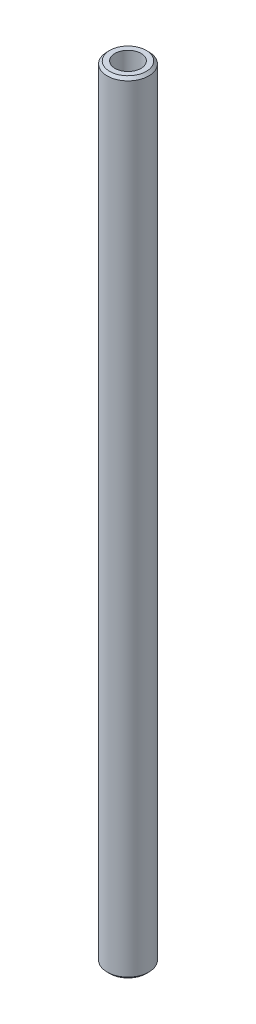
ISO-10303-21;
HEADER;
FILE_DESCRIPTION(('STEP AP214'),'2;1');
FILE_NAME('part.step','',(''),(''),'','','');
FILE_SCHEMA(('AUTOMOTIVE_DESIGN { 1 0 10303 214 1 1 1 1 }'));
ENDSEC;
DATA;
#1=APPLICATION_CONTEXT('core data for automotive mechanical design processes');
#2=APPLICATION_PROTOCOL_DEFINITION('international standard','automotive_design',2000,#1);
#3=PRODUCT_CONTEXT('',#1,'mechanical');
#4=PRODUCT('Part','Part','',(#3));
#5=PRODUCT_RELATED_PRODUCT_CATEGORY('part','',(#4));
#6=PRODUCT_DEFINITION_FORMATION('','',#4);
#7=PRODUCT_DEFINITION_CONTEXT('part definition',#1,'design');
#8=PRODUCT_DEFINITION('design','',#6,#7);
#9=PRODUCT_DEFINITION_SHAPE('','',#8);
#10=(LENGTH_UNIT() NAMED_UNIT(*) SI_UNIT(.MILLI.,.METRE.));
#11=(NAMED_UNIT(*) PLANE_ANGLE_UNIT() SI_UNIT($,.RADIAN.));
#12=(NAMED_UNIT(*) SI_UNIT($,.STERADIAN.) SOLID_ANGLE_UNIT());
#13=UNCERTAINTY_MEASURE_WITH_UNIT(LENGTH_MEASURE(1.E-05),#10,'distance_accuracy_value','');
#14=(GEOMETRIC_REPRESENTATION_CONTEXT(3) GLOBAL_UNCERTAINTY_ASSIGNED_CONTEXT((#13)) GLOBAL_UNIT_ASSIGNED_CONTEXT((#10,
#11,#12)) REPRESENTATION_CONTEXT('',''));
#15=CARTESIAN_POINT('',(0.,0.,0.));
#16=DIRECTION('',(0.,0.,1.));
#17=DIRECTION('',(1.,0.,0.));
#18=AXIS2_PLACEMENT_3D('',#15,#16,#17);
#19=CARTESIAN_POINT('',(0.,150.,0.));
#20=DIRECTION('',(0.,-1.,0.));
#21=DIRECTION('',(0.,0.,-1.));
#22=AXIS2_PLACEMENT_3D('',#19,#20,#21);
#23=CYLINDRICAL_SURFACE('',#22,4.);
#24=CARTESIAN_POINT('',(0.,149.5,0.));
#25=DIRECTION('',(0.,1.,0.));
#26=DIRECTION('',(0.,0.,1.));
#27=AXIS2_PLACEMENT_3D('',#24,#25,#26);
#28=CIRCLE('',#27,4.);
#29=CARTESIAN_POINT('',(0.,149.5,4.));
#30=VERTEX_POINT('',#29);
#31=EDGE_CURVE('E36',#30,#30,#28,.F.);
#32=ORIENTED_EDGE('',*,*,#31,.T.);
#33=EDGE_LOOP('',(#32));
#34=FACE_BOUND('',#33,.T.);
#35=CARTESIAN_POINT('',(0.,0.500000000000028,0.));
#36=DIRECTION('',(0.,1.,0.));
#37=DIRECTION('',(0.,0.,1.));
#38=AXIS2_PLACEMENT_3D('',#35,#36,#37);
#39=CIRCLE('',#38,4.);
#40=CARTESIAN_POINT('',(0.,0.500000000000028,4.));
#41=VERTEX_POINT('',#40);
#42=EDGE_CURVE('E40',#41,#41,#39,.T.);
#43=ORIENTED_EDGE('',*,*,#42,.T.);
#44=EDGE_LOOP('',(#43));
#45=FACE_BOUND('',#44,.T.);
#46=ADVANCED_FACE('F29',(#34,#45),#23,.T.);
#47=CARTESIAN_POINT('',(0.,150.,0.));
#48=DIRECTION('',(0.,1.,0.));
#49=DIRECTION('',(0.,0.,1.));
#50=AXIS2_PLACEMENT_3D('',#47,#48,#49);
#51=PLANE('',#50);
#52=CARTESIAN_POINT('',(0.,150.,0.));
#53=DIRECTION('',(0.,1.,0.));
#54=DIRECTION('',(0.,0.,1.));
#55=AXIS2_PLACEMENT_3D('',#52,#53,#54);
#56=CIRCLE('',#55,2.5);
#57=CARTESIAN_POINT('',(0.,150.,2.5));
#58=VERTEX_POINT('',#57);
#59=EDGE_CURVE('E56',#58,#58,#56,.T.);
#60=ORIENTED_EDGE('',*,*,#59,.F.);
#61=EDGE_LOOP('',(#60));
#62=FACE_BOUND('',#61,.T.);
#63=CARTESIAN_POINT('',(0.,150.,0.));
#64=DIRECTION('',(0.,1.,0.));
#65=DIRECTION('',(0.,0.,1.));
#66=AXIS2_PLACEMENT_3D('',#63,#64,#65);
#67=CIRCLE('',#66,3.50000000000002);
#68=CARTESIAN_POINT('',(0.,150.,3.50000000000002));
#69=VERTEX_POINT('',#68);
#70=EDGE_CURVE('E44',#69,#69,#67,.T.);
#71=ORIENTED_EDGE('',*,*,#70,.T.);
#72=EDGE_LOOP('',(#71));
#73=FACE_BOUND('',#72,.T.);
#74=ADVANCED_FACE('F71',(#62,#73),#51,.T.);
#75=CARTESIAN_POINT('',(0.,0.,0.));
#76=DIRECTION('',(0.,1.,0.));
#77=DIRECTION('',(0.,0.,1.));
#78=AXIS2_PLACEMENT_3D('',#75,#76,#77);
#79=PLANE('',#78);
#80=CARTESIAN_POINT('',(0.,0.,0.));
#81=DIRECTION('',(0.,-1.,0.));
#82=DIRECTION('',(0.,0.,-1.));
#83=AXIS2_PLACEMENT_3D('',#80,#81,#82);
#84=CIRCLE('',#83,2.5);
#85=CARTESIAN_POINT('',(0.,0.,-2.5));
#86=VERTEX_POINT('',#85);
#87=EDGE_CURVE('E50',#86,#86,#84,.T.);
#88=ORIENTED_EDGE('',*,*,#87,.F.);
#89=EDGE_LOOP('',(#88));
#90=FACE_BOUND('',#89,.T.);
#91=CARTESIAN_POINT('',(0.,0.,0.));
#92=DIRECTION('',(0.,1.,0.));
#93=DIRECTION('',(0.,0.,1.));
#94=AXIS2_PLACEMENT_3D('',#91,#92,#93);
#95=CIRCLE('',#94,3.49999999999996);
#96=CARTESIAN_POINT('',(0.,0.,3.49999999999996));
#97=VERTEX_POINT('',#96);
#98=EDGE_CURVE('E10',#97,#97,#95,.F.);
#99=ORIENTED_EDGE('',*,*,#98,.T.);
#100=EDGE_LOOP('',(#99));
#101=FACE_BOUND('',#100,.T.);
#102=ADVANCED_FACE('F74',(#90,#101),#79,.F.);
#103=CARTESIAN_POINT('',(0.,150.,0.));
#104=DIRECTION('',(0.,-1.,0.));
#105=DIRECTION('',(0.,0.,-1.));
#106=AXIS2_PLACEMENT_3D('',#103,#104,#105);
#107=CONICAL_SURFACE('',#106,3.50000000000002,0.785398163397459);
#108=ORIENTED_EDGE('',*,*,#31,.F.);
#109=EDGE_LOOP('',(#108));
#110=FACE_BOUND('',#109,.T.);
#111=ORIENTED_EDGE('',*,*,#70,.F.);
#112=EDGE_LOOP('',(#111));
#113=FACE_BOUND('',#112,.T.);
#114=ADVANCED_FACE('F78',(#110,#113),#107,.T.);
#115=CARTESIAN_POINT('',(0.,0.500000000000028,0.));
#116=DIRECTION('',(0.,1.,0.));
#117=DIRECTION('',(0.,0.,1.));
#118=AXIS2_PLACEMENT_3D('',#115,#116,#117);
#119=CONICAL_SURFACE('',#118,4.,0.785398163397459);
#120=ORIENTED_EDGE('',*,*,#98,.F.);
#121=EDGE_LOOP('',(#120));
#122=FACE_BOUND('',#121,.T.);
#123=ORIENTED_EDGE('',*,*,#42,.F.);
#124=EDGE_LOOP('',(#123));
#125=FACE_BOUND('',#124,.T.);
#126=ADVANCED_FACE('F31',(#122,#125),#119,.T.);
#127=CARTESIAN_POINT('',(0.,15.,0.));
#128=DIRECTION('',(0.,-1.,0.));
#129=DIRECTION('',(0.,0.,-1.));
#130=AXIS2_PLACEMENT_3D('',#127,#128,#129);
#131=CYLINDRICAL_SURFACE('',#130,2.5);
#132=CARTESIAN_POINT('',(0.,15.,0.));
#133=DIRECTION('',(0.,-1.,0.));
#134=DIRECTION('',(0.,0.,-1.));
#135=AXIS2_PLACEMENT_3D('',#132,#133,#134);
#136=CIRCLE('',#135,2.5);
#137=CARTESIAN_POINT('',(0.,15.,-2.5));
#138=VERTEX_POINT('',#137);
#139=EDGE_CURVE('E49',#138,#138,#136,.T.);
#140=ORIENTED_EDGE('',*,*,#139,.F.);
#141=EDGE_LOOP('',(#140));
#142=FACE_BOUND('',#141,.T.);
#143=ORIENTED_EDGE('',*,*,#87,.T.);
#144=EDGE_LOOP('',(#143));
#145=FACE_BOUND('',#144,.T.);
#146=ADVANCED_FACE('F85',(#142,#145),#131,.F.);
#147=CARTESIAN_POINT('',(0.,15.,0.));
#148=DIRECTION('',(0.,-1.,0.));
#149=DIRECTION('',(0.,0.,-1.));
#150=AXIS2_PLACEMENT_3D('',#147,#148,#149);
#151=PLANE('',#150);
#152=ORIENTED_EDGE('',*,*,#139,.T.);
#153=EDGE_LOOP('',(#152));
#154=FACE_BOUND('',#153,.T.);
#155=ADVANCED_FACE('F67',(#154),#151,.T.);
#156=CARTESIAN_POINT('',(0.,135.,0.));
#157=DIRECTION('',(0.,1.,0.));
#158=DIRECTION('',(0.,0.,1.));
#159=AXIS2_PLACEMENT_3D('',#156,#157,#158);
#160=CYLINDRICAL_SURFACE('',#159,2.5);
#161=CARTESIAN_POINT('',(0.,135.,0.));
#162=DIRECTION('',(0.,1.,0.));
#163=DIRECTION('',(0.,0.,1.));
#164=AXIS2_PLACEMENT_3D('',#161,#162,#163);
#165=CIRCLE('',#164,2.5);
#166=CARTESIAN_POINT('',(0.,135.,2.5));
#167=VERTEX_POINT('',#166);
#168=EDGE_CURVE('E53',#167,#167,#165,.T.);
#169=ORIENTED_EDGE('',*,*,#168,.F.);
#170=EDGE_LOOP('',(#169));
#171=FACE_BOUND('',#170,.T.);
#172=ORIENTED_EDGE('',*,*,#59,.T.);
#173=EDGE_LOOP('',(#172));
#174=FACE_BOUND('',#173,.T.);
#175=ADVANCED_FACE('F64',(#171,#174),#160,.F.);
#176=CARTESIAN_POINT('',(0.,135.,0.));
#177=DIRECTION('',(0.,1.,0.));
#178=DIRECTION('',(0.,0.,1.));
#179=AXIS2_PLACEMENT_3D('',#176,#177,#178);
#180=PLANE('',#179);
#181=ORIENTED_EDGE('',*,*,#168,.T.);
#182=EDGE_LOOP('',(#181));
#183=FACE_BOUND('',#182,.T.);
#184=ADVANCED_FACE('F62',(#183),#180,.T.);
#185=CLOSED_SHELL('',(#46,#74,#102,#114,#126,#146,#155,#175,#184));
#186=MANIFOLD_SOLID_BREP('B2',#185);
#187=ADVANCED_BREP_SHAPE_REPRESENTATION('',(#18,#186),#14);
#188=SHAPE_DEFINITION_REPRESENTATION(#9,#187);
ENDSEC;
END-ISO-10303-21;
